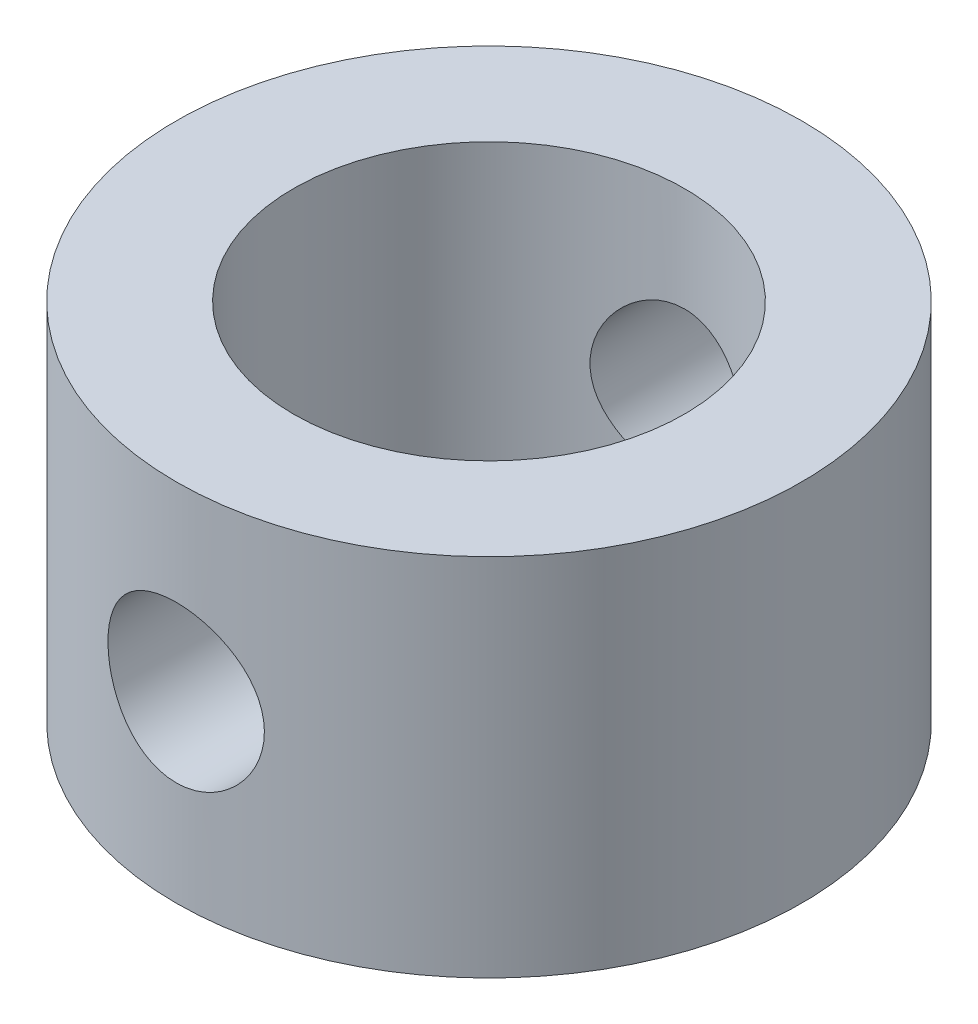
ISO-10303-21;
HEADER;
FILE_DESCRIPTION(('STEP AP214'),'2;1');
FILE_NAME('part.step','',(''),(''),'','','');
FILE_SCHEMA(('AUTOMOTIVE_DESIGN { 1 0 10303 214 1 1 1 1 }'));
ENDSEC;
DATA;
#1=APPLICATION_CONTEXT('core data for automotive mechanical design processes');
#2=APPLICATION_PROTOCOL_DEFINITION('international standard','automotive_design',2000,#1);
#3=PRODUCT_CONTEXT('',#1,'mechanical');
#4=PRODUCT('Part','Part','',(#3));
#5=PRODUCT_RELATED_PRODUCT_CATEGORY('part','',(#4));
#6=PRODUCT_DEFINITION_FORMATION('','',#4);
#7=PRODUCT_DEFINITION_CONTEXT('part definition',#1,'design');
#8=PRODUCT_DEFINITION('design','',#6,#7);
#9=PRODUCT_DEFINITION_SHAPE('','',#8);
#10=(LENGTH_UNIT() NAMED_UNIT(*) SI_UNIT(.MILLI.,.METRE.));
#11=(NAMED_UNIT(*) PLANE_ANGLE_UNIT() SI_UNIT($,.RADIAN.));
#12=(NAMED_UNIT(*) SI_UNIT($,.STERADIAN.) SOLID_ANGLE_UNIT());
#13=UNCERTAINTY_MEASURE_WITH_UNIT(LENGTH_MEASURE(1.E-05),#10,'distance_accuracy_value','');
#14=(GEOMETRIC_REPRESENTATION_CONTEXT(3) GLOBAL_UNCERTAINTY_ASSIGNED_CONTEXT((#13)) GLOBAL_UNIT_ASSIGNED_CONTEXT((#10,
#11,#12)) REPRESENTATION_CONTEXT('',''));
#15=CARTESIAN_POINT('',(0.,0.,0.));
#16=DIRECTION('',(0.,0.,1.));
#17=DIRECTION('',(1.,0.,0.));
#18=AXIS2_PLACEMENT_3D('',#15,#16,#17);
#19=CARTESIAN_POINT('',(0.,7.,0.));
#20=DIRECTION('',(0.,1.,0.));
#21=DIRECTION('',(0.,0.,1.));
#22=AXIS2_PLACEMENT_3D('',#19,#20,#21);
#23=PLANE('',#22);
#24=CARTESIAN_POINT('',(0.,7.,0.));
#25=DIRECTION('',(0.,1.,0.));
#26=DIRECTION('',(0.,0.,1.));
#27=AXIS2_PLACEMENT_3D('',#24,#25,#26);
#28=CIRCLE('',#27,12.);
#29=CARTESIAN_POINT('',(0.,7.,12.));
#30=VERTEX_POINT('',#29);
#31=EDGE_CURVE('E10',#30,#30,#28,.T.);
#32=ORIENTED_EDGE('',*,*,#31,.T.);
#33=EDGE_LOOP('',(#32));
#34=FACE_BOUND('',#33,.T.);
#35=CARTESIAN_POINT('',(0.,7.,0.));
#36=DIRECTION('',(0.,1.,0.));
#37=DIRECTION('',(0.,0.,1.));
#38=AXIS2_PLACEMENT_3D('',#35,#36,#37);
#39=CIRCLE('',#38,7.5);
#40=CARTESIAN_POINT('',(0.,7.,7.5));
#41=VERTEX_POINT('',#40);
#42=EDGE_CURVE('E62',#41,#41,#39,.T.);
#43=ORIENTED_EDGE('',*,*,#42,.F.);
#44=EDGE_LOOP('',(#43));
#45=FACE_BOUND('',#44,.T.);
#46=ADVANCED_FACE('F41',(#34,#45),#23,.T.);
#47=CARTESIAN_POINT('',(0.,-7.,0.));
#48=DIRECTION('',(0.,1.,0.));
#49=DIRECTION('',(0.,0.,1.));
#50=AXIS2_PLACEMENT_3D('',#47,#48,#49);
#51=PLANE('',#50);
#52=CARTESIAN_POINT('',(0.,-7.,0.));
#53=DIRECTION('',(0.,1.,0.));
#54=DIRECTION('',(0.,0.,1.));
#55=AXIS2_PLACEMENT_3D('',#52,#53,#54);
#56=CIRCLE('',#55,12.);
#57=CARTESIAN_POINT('',(0.,-7.,12.));
#58=VERTEX_POINT('',#57);
#59=EDGE_CURVE('E56',#58,#58,#56,.T.);
#60=ORIENTED_EDGE('',*,*,#59,.F.);
#61=EDGE_LOOP('',(#60));
#62=FACE_BOUND('',#61,.T.);
#63=CARTESIAN_POINT('',(0.,-7.,0.));
#64=DIRECTION('',(0.,1.,0.));
#65=DIRECTION('',(0.,0.,1.));
#66=AXIS2_PLACEMENT_3D('',#63,#64,#65);
#67=CIRCLE('',#66,7.5);
#68=CARTESIAN_POINT('',(0.,-7.,7.5));
#69=VERTEX_POINT('',#68);
#70=EDGE_CURVE('E65',#69,#69,#67,.T.);
#71=ORIENTED_EDGE('',*,*,#70,.T.);
#72=EDGE_LOOP('',(#71));
#73=FACE_BOUND('',#72,.T.);
#74=ADVANCED_FACE('F106',(#62,#73),#51,.F.);
#75=CARTESIAN_POINT('',(0.,7.,0.));
#76=DIRECTION('',(0.,-1.,0.));
#77=DIRECTION('',(0.,0.,-1.));
#78=AXIS2_PLACEMENT_3D('',#75,#76,#77);
#79=CYLINDRICAL_SURFACE('',#78,12.);
#80=CARTESIAN_POINT('',(0.,3.,-12.));
#81=CARTESIAN_POINT('',(-0.165752177339462,2.99999534852368,-11.9999971973602));
#82=CARTESIAN_POINT('',(-0.331556315661527,2.98621689845242,-11.9965315626365));
#83=CARTESIAN_POINT('',(-0.658412647541066,2.93154969738599,-11.9830422765979));
#84=CARTESIAN_POINT('',(-0.819462093741479,2.8906455809243,-11.9730149083995));
#85=CARTESIAN_POINT('',(-1.13204174436515,2.78312149307583,-11.9475125266406));
#86=CARTESIAN_POINT('',(-1.28358312686,2.71653240256946,-11.9320440568412));
#87=CARTESIAN_POINT('',(-1.57334426380886,2.55963721991032,-11.8973068761524));
#88=CARTESIAN_POINT('',(-1.71156356869753,2.46933032776207,-11.8780380370831));
#89=CARTESIAN_POINT('',(-1.97360385460183,2.26559842069164,-11.8373482718339));
#90=CARTESIAN_POINT('',(-2.09711138012211,2.15177685008188,-11.8158941429625));
#91=CARTESIAN_POINT('',(-2.32349785440664,1.90509559018193,-11.7734724023587));
#92=CARTESIAN_POINT('',(-2.42637447389838,1.77223375410613,-11.7525048457974));
#93=CARTESIAN_POINT('',(-2.61005308559795,1.48880954652602,-11.7130955139634));
#94=CARTESIAN_POINT('',(-2.69050443185028,1.33801353838254,-11.6946958892962));
#95=CARTESIAN_POINT('',(-2.82479381710149,1.02450317667993,-11.6629898963603));
#96=CARTESIAN_POINT('',(-2.87863611088028,0.861790733335969,-11.6496827138884));
#97=CARTESIAN_POINT('',(-2.95710967360953,0.53251300359668,-11.6300095339265));
#98=CARTESIAN_POINT('',(-2.98230453666411,0.366090207924015,-11.6235098199402));
#99=CARTESIAN_POINT('',(-3.00452355013282,0.0312628620013088,-11.6177872491918));
#100=CARTESIAN_POINT('',(-3.00155228363622,-0.137141361384274,-11.6185632085586));
#101=CARTESIAN_POINT('',(-2.96797304927941,-0.466831615490707,-11.6271841103363));
#102=CARTESIAN_POINT('',(-2.93803668038127,-0.628191242930661,-11.6348572601459));
#103=CARTESIAN_POINT('',(-2.85244837380599,-0.943522101822118,-11.6561341934214));
#104=CARTESIAN_POINT('',(-2.79679460413879,-1.09749280605784,-11.6697383993848));
#105=CARTESIAN_POINT('',(-2.66077895587437,-1.39547603250426,-11.7015022781132));
#106=CARTESIAN_POINT('',(-2.58017333446584,-1.53937234357914,-11.7197065493963));
#107=CARTESIAN_POINT('',(-2.39671255202989,-1.81183741951364,-11.7585942169198));
#108=CARTESIAN_POINT('',(-2.29385349761767,-1.9404034961345,-11.7792780466926));
#109=CARTESIAN_POINT('',(-2.06532684936244,-2.18240723138881,-11.8215176107978));
#110=CARTESIAN_POINT('',(-1.93909251633172,-2.2953089801227,-11.84308138956));
#111=CARTESIAN_POINT('',(-1.6692238350074,-2.49844248492781,-11.8841193115751));
#112=CARTESIAN_POINT('',(-1.52558895541589,-2.58867354852713,-11.9035933909882));
#113=CARTESIAN_POINT('',(-1.22423177736278,-2.74410117244877,-11.9383546418838));
#114=CARTESIAN_POINT('',(-1.06646278641725,-2.80921068050886,-11.9536272025545));
#115=CARTESIAN_POINT('',(-0.741752016285765,-2.91183461141915,-11.9781583398283));
#116=CARTESIAN_POINT('',(-0.574811998300969,-2.94935431283628,-11.9874180667856));
#117=CARTESIAN_POINT('',(-0.241079940780053,-2.99491513111768,-11.9987099854275));
#118=CARTESIAN_POINT('',(-0.074393439976419,-3.00368605215061,-12.0009210701655));
#119=CARTESIAN_POINT('',(0.258065749603018,-2.99350199588902,-11.998376096289));
#120=CARTESIAN_POINT('',(0.423838519289193,-2.97454951440173,-11.9936206648371));
#121=CARTESIAN_POINT('',(0.747228537552982,-2.91005818321725,-11.977791622547));
#122=CARTESIAN_POINT('',(0.904930237937501,-2.86491747304605,-11.9668126837158));
#123=CARTESIAN_POINT('',(1.21051458490503,-2.74978583194308,-11.9397741326831));
#124=CARTESIAN_POINT('',(1.3583962380653,-2.67979239137356,-11.9237140073996));
#125=CARTESIAN_POINT('',(1.64304626885966,-2.51552774225065,-11.8878661585244));
#126=CARTESIAN_POINT('',(1.77957088367153,-2.42084777520687,-11.868017347332));
#127=CARTESIAN_POINT('',(2.03505322728662,-2.21042018240566,-11.826890183755));
#128=CARTESIAN_POINT('',(2.1540079179465,-2.0946689207647,-11.8056115850589));
#129=CARTESIAN_POINT('',(2.37398113614497,-1.84199607831259,-11.76337913919));
#130=CARTESIAN_POINT('',(2.47448773524221,-1.70462459400088,-11.7424460836496));
#131=CARTESIAN_POINT('',(2.65102151802725,-1.41453473106284,-11.7038575676408));
#132=CARTESIAN_POINT('',(2.72704978832281,-1.26181703405911,-11.6862019616993));
#133=CARTESIAN_POINT('',(2.85190284121468,-0.946188555187524,-11.656361894336));
#134=CARTESIAN_POINT('',(2.90088879328717,-0.783344743375404,-11.6441451045097));
#135=CARTESIAN_POINT('',(2.97069131988587,-0.451380724289409,-11.626534880479));
#136=CARTESIAN_POINT('',(2.99151405495183,-0.2822618979571,-11.6211399540485));
#137=CARTESIAN_POINT('',(3.004077180673,0.0522420477232175,-11.6178980244194));
#138=CARTESIAN_POINT('',(2.99663579556158,0.217594870252894,-11.6198386546564));
#139=CARTESIAN_POINT('',(2.95475455662439,0.544607777332531,-11.6305581800657));
#140=CARTESIAN_POINT('',(2.92031524537318,0.706267936026385,-11.6393369378128));
#141=CARTESIAN_POINT('',(2.82586263888594,1.02041691813173,-11.6626252136787));
#142=CARTESIAN_POINT('',(2.76600280936085,1.17295461048066,-11.6771003047327));
#143=CARTESIAN_POINT('',(2.62252982721005,1.46593076542713,-11.7101551144901));
#144=CARTESIAN_POINT('',(2.53891338006835,1.60636754637377,-11.7287354024137));
#145=CARTESIAN_POINT('',(2.3477354972743,1.87510925800411,-11.7685126852721));
#146=CARTESIAN_POINT('',(2.23960632582452,2.00300214684794,-11.7897652966356));
#147=CARTESIAN_POINT('',(2.00357874237946,2.2390940895908,-11.8321605449252));
#148=CARTESIAN_POINT('',(1.87567564252229,2.34728846022593,-11.8533031545411));
#149=CARTESIAN_POINT('',(1.60093517340518,2.54282261712922,-11.8935531129534));
#150=CARTESIAN_POINT('',(1.45379684463277,2.62974922734316,-11.9126166673174));
#151=CARTESIAN_POINT('',(1.14653211902095,2.77749492588106,-11.9460984995023));
#152=CARTESIAN_POINT('',(0.986415126873477,2.83833272129707,-11.9605201039956));
#153=CARTESIAN_POINT('',(0.688820506486943,2.92314366065931,-11.9809611913108));
#154=CARTESIAN_POINT('',(0.552760341816137,2.95190248610687,-11.9880517010538));
#155=CARTESIAN_POINT('',(0.277812143072566,2.99033188724388,-11.997572104639));
#156=CARTESIAN_POINT('',(0.138924322485232,3.0000038986106,-12.0000023490179));
#157=CARTESIAN_POINT('',(0.,3.,-12.));
#158=B_SPLINE_CURVE_WITH_KNOTS('',3,(#80,#81,#82,#83,#84,#85,#86,#87,#88,#89,#90,#91,#92,#93,
#94,#95,#96,#97,#98,#99,#100,#101,#102,#103,#104,#105,#106,#107,#108,#109,#110,#111,#112,#113,
#114,#115,#116,#117,#118,#119,#120,#121,#122,#123,#124,#125,#126,#127,#128,#129,#130,#131,#132,
#133,#134,#135,#136,#137,#138,#139,#140,#141,#142,#143,#144,#145,#146,#147,#148,#149,#150,#151,
#152,#153,#154,#155,#156,#157),.UNSPECIFIED.,.T.,.F.,(4,2,2,2,2,2,2,2,2,2,2,2,2,2,2,2,2,2,2,2,2,
2,2,2,2,2,2,2,2,2,2,2,2,2,2,2,2,2,4),(0.,0.49674742494378,0.993776475527799,1.49020980457221,
1.98665988033866,2.49228870874278,2.99797459160124,3.51117295091614,4.02428922338737,
4.5271259020214,5.02988076232035,5.52044994020678,6.01105406938718,6.506610557544,
7.00225381678967,7.5120300194468,8.02182179123136,8.5333645802487,9.04480947383927,
9.54316617905194,10.0414780223213,10.5324054903472,11.0233825465122,11.5230717513735,
12.0228472602268,12.5348901841559,13.0469103750566,13.5558450923716,14.0646684651657,
14.5588756080898,15.0530728192383,15.5443280113065,16.0356513628556,16.5397915283158,
17.0440513955259,17.5574437101093,18.0704672765446,18.4868448589605,18.9031911209784),.UNSPECIFIED.);
#159=CARTESIAN_POINT('',(0.,3.,-12.));
#160=VERTEX_POINT('',#159);
#161=EDGE_CURVE('E92',#160,#160,#158,.T.);
#162=ORIENTED_EDGE('',*,*,#161,.T.);
#163=EDGE_LOOP('',(#162));
#164=FACE_BOUND('',#163,.T.);
#165=CARTESIAN_POINT('',(3.,0.,11.6189500386223));
#166=CARTESIAN_POINT('',(2.99999529431169,-0.165660901111892,11.6189532010543));
#167=CARTESIAN_POINT('',(2.98623149459718,-0.331373878414226,11.6225316721752));
#168=CARTESIAN_POINT('',(2.93162775055655,-0.658041093808211,11.6364223439108));
#169=CARTESIAN_POINT('',(2.89077204809053,-0.818992505361822,11.6467384634596));
#170=CARTESIAN_POINT('',(2.78338943955845,-1.13136424582462,11.6728646951538));
#171=CARTESIAN_POINT('',(2.71689567342539,-1.28279658646285,11.6886677122855));
#172=CARTESIAN_POINT('',(2.56022536951366,-1.57237302304786,11.7239783043451));
#173=CARTESIAN_POINT('',(2.47004782627282,-1.71051655449626,11.7434860365419));
#174=CARTESIAN_POINT('',(2.26645011277426,-1.97263397431466,11.7844885962675));
#175=CARTESIAN_POINT('',(2.15260426524486,-2.09627232042006,11.8060151714764));
#176=CARTESIAN_POINT('',(1.9058184769208,-2.32291367323241,11.8483545061835));
#177=CARTESIAN_POINT('',(1.77287675301637,-2.4259147507461,11.8691671987967));
#178=CARTESIAN_POINT('',(1.48937424129475,-2.60973056115753,11.908084986247));
#179=CARTESIAN_POINT('',(1.33859349143414,-2.69021566579376,11.9261482488071));
#180=CARTESIAN_POINT('',(1.02511582115131,-2.8245715729837,11.9571697431118));
#181=CARTESIAN_POINT('',(0.862420662950329,-2.87844630229862,11.9701287280121));
#182=CARTESIAN_POINT('',(0.533230510504994,-2.9569774014943,11.9892571061782));
#183=CARTESIAN_POINT('',(0.366879263458771,-2.9822035731919,11.9955587261318));
#184=CARTESIAN_POINT('',(0.0321945831153235,-3.00451005513066,12.0011231292876));
#185=CARTESIAN_POINT('',(-0.136138553445682,-3.00159452665152,12.0003869531605));
#186=CARTESIAN_POINT('',(-0.466056741517162,-2.96811017969983,11.9920571394424));
#187=CARTESIAN_POINT('',(-0.627708646803201,-2.93815640993537,11.9846160280904));
#188=CARTESIAN_POINT('',(-0.943614742241059,-2.8524344759418,11.9638900382983));
#189=CARTESIAN_POINT('',(-1.09786853811131,-2.79666493754711,11.9506048487814));
#190=CARTESIAN_POINT('',(-1.39622011050542,-2.66039691517552,11.9194501164106));
#191=CARTESIAN_POINT('',(-1.54021352929951,-2.57967954640591,11.9015402363401));
#192=CARTESIAN_POINT('',(-1.81282686702147,-2.39597318506049,11.8630788457163));
#193=CARTESIAN_POINT('',(-1.94144410525652,-2.29298031772725,11.8425268758318));
#194=CARTESIAN_POINT('',(-2.18332210525487,-2.06434950962116,11.8003645652323));
#195=CARTESIAN_POINT('',(-2.29607303722559,-1.93817412918271,11.7787406343036));
#196=CARTESIAN_POINT('',(-2.49892912788907,-1.66848003175166,11.7373805222079));
#197=CARTESIAN_POINT('',(-2.58903322813808,-1.52496050461067,11.7176444292995));
#198=CARTESIAN_POINT('',(-2.74436438706776,-1.22365195902137,11.6822459619518));
#199=CARTESIAN_POINT('',(-2.80946870091135,-1.06579712362463,11.6666038046041));
#200=CARTESIAN_POINT('',(-2.91205686190915,-0.740897438307787,11.641423681784));
#201=CARTESIAN_POINT('',(-2.94954661965919,-0.573854563218483,11.6318844101128));
#202=CARTESIAN_POINT('',(-2.99499556639911,-0.240048598164097,11.6202642720895));
#203=CARTESIAN_POINT('',(-3.00370856870294,-0.0733946479907702,11.6179930677232));
#204=CARTESIAN_POINT('',(-2.99342038861819,0.258986323902306,11.6206481203763));
#205=CARTESIAN_POINT('',(-2.97442175741976,0.424713429539331,11.6255737148436));
#206=CARTESIAN_POINT('',(-2.9099105567259,0.747737117938289,11.6418849838198));
#207=CARTESIAN_POINT('',(-2.86483688193829,0.905127271883039,11.6531636429104));
#208=CARTESIAN_POINT('',(-2.74994169800455,1.21011774942399,11.6808086191537));
#209=CARTESIAN_POINT('',(-2.680117257255,1.35771691086694,11.6971755389569));
#210=CARTESIAN_POINT('',(-2.51612480152392,1.64212953344028,11.7335536451461));
#211=CARTESIAN_POINT('',(-2.42150610460277,1.77867460805158,11.7536300232869));
#212=CARTESIAN_POINT('',(-2.21118087880335,2.03422603536177,11.7950049968534));
#213=CARTESIAN_POINT('',(-2.09547088441632,2.15322949998013,11.8163037927397));
#214=CARTESIAN_POINT('',(-1.84278816295418,2.37337325108511,11.8583688363813));
#215=CARTESIAN_POINT('',(-1.70535585759478,2.47399207505856,11.8791084247426));
#216=CARTESIAN_POINT('',(-1.41510804808403,2.6507230403415,11.9171665993643));
#217=CARTESIAN_POINT('',(-1.26229334687277,2.72683645992985,11.9344853640474));
#218=CARTESIAN_POINT('',(-0.946674605193272,2.85173524143352,11.9636413888599));
#219=CARTESIAN_POINT('',(-0.783952143083647,2.90071714125488,11.9755179602689));
#220=CARTESIAN_POINT('',(-0.452249280956421,2.9705524015301,11.9926235207495));
#221=CARTESIAN_POINT('',(-0.283270095123721,2.99141119048685,11.9978537927211));
#222=CARTESIAN_POINT('',(0.0512505793299699,3.00410276872662,12.0010250822642));
#223=CARTESIAN_POINT('',(0.216761480898066,2.99670512728622,11.9991593663997));
#224=CARTESIAN_POINT('',(0.544102489244253,2.95485651811695,11.9887768937233));
#225=CARTESIAN_POINT('',(0.705932705342786,2.92040635496049,11.9802603347151));
#226=CARTESIAN_POINT('',(1.02051310693432,2.82584334068742,11.9575629856167));
#227=CARTESIAN_POINT('',(1.17330748374259,2.76586964005686,11.9434129350718));
#228=CARTESIAN_POINT('',(1.46675115912487,2.62208826294128,11.9109386674097));
#229=CARTESIAN_POINT('',(1.6073989237969,2.53827758198855,11.8926139241627));
#230=CARTESIAN_POINT('',(1.87620578526991,2.3468542980116,11.8532174904086));
#231=CARTESIAN_POINT('',(2.00398496489501,2.23871957128851,11.8320905082499));
#232=CARTESIAN_POINT('',(2.23984506082051,2.00273144406796,11.7897194717157));
#233=CARTESIAN_POINT('',(2.34792097522977,1.87487305166651,11.7684753890191));
#234=CARTESIAN_POINT('',(2.5432860794155,1.60019575743162,11.7278242753651));
#235=CARTESIAN_POINT('',(2.63014985824914,1.45306762990424,11.7084589101987));
#236=CARTESIAN_POINT('',(2.77778068975641,1.14583353037554,11.6743186648448));
#237=CARTESIAN_POINT('',(2.83856672925646,0.985737101718459,11.6595404469964));
#238=CARTESIAN_POINT('',(2.92326758571301,0.688268964494517,11.6385572625221));
#239=CARTESIAN_POINT('',(2.95197951179064,0.552320506841589,11.631259890105));
#240=CARTESIAN_POINT('',(2.99034687771531,0.277593393006936,11.6214551574786));
#241=CARTESIAN_POINT('',(3.00000394311525,0.138814979266793,11.6189473886732));
#242=CARTESIAN_POINT('',(3.,0.,11.6189500386223));
#243=B_SPLINE_CURVE_WITH_KNOTS('',3,(#165,#166,#167,#168,#169,#170,#171,#172,#173,#174,#175,
#176,#177,#178,#179,#180,#181,#182,#183,#184,#185,#186,#187,#188,#189,#190,#191,#192,#193,#194,
#195,#196,#197,#198,#199,#200,#201,#202,#203,#204,#205,#206,#207,#208,#209,#210,#211,#212,#213,
#214,#215,#216,#217,#218,#219,#220,#221,#222,#223,#224,#225,#226,#227,#228,#229,#230,#231,#232,
#233,#234,#235,#236,#237,#238,#239,#240,#241,#242),.UNSPECIFIED.,.T.,.F.,(4,2,2,2,2,2,2,2,2,2,2,
2,2,2,2,2,2,2,2,2,2,2,2,2,2,2,2,2,2,2,2,2,2,2,2,2,2,2,4),(0.,0.496472930083363,
0.993234889714399,1.48935687259922,1.98549992106574,2.49148745031571,2.9975222577584,
3.51061795677504,4.02363791816511,4.52626501194416,5.02881778399225,5.52021915226736,
6.01164668069743,6.50751449105334,7.00346862562696,7.51284559886294,8.02224637439763,
8.53411718410083,9.04587840155457,9.54412289717045,10.042321526265,10.5323688601698,
11.0224742571164,11.5221941503692,12.0219962266799,12.5343039716432,13.046584988694,
13.5551048737425,14.0635265869678,14.5582013535888,15.0528614085831,15.5448585187759,
16.0369176689162,16.5407651590442,17.0447403788455,17.5581177274936,18.0711206565002,
18.4871739262287,18.903191701295),.UNSPECIFIED.);
#244=CARTESIAN_POINT('',(3.,0.,11.6189500386223));
#245=VERTEX_POINT('',#244);
#246=EDGE_CURVE('E86',#245,#245,#243,.T.);
#247=ORIENTED_EDGE('',*,*,#246,.T.);
#248=EDGE_LOOP('',(#247));
#249=FACE_BOUND('',#248,.T.);
#250=ORIENTED_EDGE('',*,*,#31,.F.);
#251=EDGE_LOOP('',(#250));
#252=FACE_BOUND('',#251,.T.);
#253=ORIENTED_EDGE('',*,*,#59,.T.);
#254=EDGE_LOOP('',(#253));
#255=FACE_BOUND('',#254,.T.);
#256=ADVANCED_FACE('F43',(#164,#249,#252,#255),#79,.T.);
#257=CARTESIAN_POINT('',(0.,7.,0.));
#258=DIRECTION('',(0.,-1.,0.));
#259=DIRECTION('',(0.,0.,-1.));
#260=AXIS2_PLACEMENT_3D('',#257,#258,#259);
#261=CYLINDRICAL_SURFACE('',#260,7.5);
#262=CARTESIAN_POINT('',(0.,3.,-7.5));
#263=CARTESIAN_POINT('',(-0.0806632009395358,2.9999983890229,-7.49999888970472));
#264=CARTESIAN_POINT('',(-0.161354413498373,2.99674011548,-7.4986936895007));
#265=CARTESIAN_POINT('',(-0.322146094522253,2.9837470954671,-7.49351186176526));
#266=CARTESIAN_POINT('',(-0.402246157981983,2.97400826254011,-7.48963361174618));
#267=CARTESIAN_POINT('',(-0.641096781067452,2.9351288598822,-7.47424634808757));
#268=CARTESIAN_POINT('',(-0.79815808252172,2.89632569245522,-7.45898522266242));
#269=CARTESIAN_POINT('',(-1.10247033899881,2.79468577218911,-7.42011459126984));
#270=CARTESIAN_POINT('',(-1.24975157753076,2.73192770096983,-7.39653243529675));
#271=CARTESIAN_POINT('',(-1.53159737405797,2.58447126970495,-7.34334877224069));
#272=CARTESIAN_POINT('',(-1.66616632427491,2.49978052573424,-7.31374935540466));
#273=CARTESIAN_POINT('',(-1.92525452632722,2.30664674369764,-7.24996340359365));
#274=CARTESIAN_POINT('',(-2.04909421803168,2.19734001336868,-7.2156344837394));
#275=CARTESIAN_POINT('',(-2.27726169757605,1.95989999705686,-7.14690862377684));
#276=CARTESIAN_POINT('',(-2.38157993941976,1.8317575548035,-7.11251165865921));
#277=CARTESIAN_POINT('',(-2.5723120820679,1.55335789398784,-7.04584188546733));
#278=CARTESIAN_POINT('',(-2.65772253361338,1.40237027079118,-7.01373174174385));
#279=CARTESIAN_POINT('',(-2.80163201676496,1.08669540254387,-6.95750470553339));
#280=CARTESIAN_POINT('',(-2.86014383023324,0.922014708274903,-6.93338401809298));
#281=CARTESIAN_POINT('',(-2.94584825055478,0.591431499566553,-6.8973953654561));
#282=CARTESIAN_POINT('',(-2.974340952837,0.425923146617134,-6.88502130539265));
#283=CARTESIAN_POINT('',(-3.00325943833354,0.0920475025576348,-6.87246006067861));
#284=CARTESIAN_POINT('',(-3.00369902341366,-0.0763183419086437,-6.87226688315068));
#285=CARTESIAN_POINT('',(-2.97748405223855,-0.398635007225333,-6.88365750391268));
#286=CARTESIAN_POINT('',(-2.95271297167583,-0.552773571723856,-6.89442262441713));
#287=CARTESIAN_POINT('',(-2.87992032013237,-0.854489334113111,-6.92514281294201));
#288=CARTESIAN_POINT('',(-2.83189469212407,-1.00206538218921,-6.94509948450627));
#289=CARTESIAN_POINT('',(-2.71304209891512,-1.29002675426026,-6.99239227665171));
#290=CARTESIAN_POINT('',(-2.64176979349676,-1.43020385857296,-7.0198706892988));
#291=CARTESIAN_POINT('',(-2.47875969107453,-1.69712372455143,-7.07907174576133));
#292=CARTESIAN_POINT('',(-2.38701420764467,-1.82386141410673,-7.11079598182861));
#293=CARTESIAN_POINT('',(-2.17732589918875,-2.07061459320028,-7.17790105116005));
#294=CARTESIAN_POINT('',(-2.05790619445786,-2.1893530941683,-7.21337497464924));
#295=CARTESIAN_POINT('',(-1.80047164114338,-2.40552671700379,-7.28189737436726));
#296=CARTESIAN_POINT('',(-1.66245309800113,-2.50295759611564,-7.31494536667799));
#297=CARTESIAN_POINT('',(-1.36811647890929,-2.67542617112355,-7.37572021897015));
#298=CARTESIAN_POINT('',(-1.21149073701985,-2.74998342179553,-7.40332905143173));
#299=CARTESIAN_POINT('',(-0.886535648224183,-2.87125179161714,-7.44922242493087));
#300=CARTESIAN_POINT('',(-0.718212295274479,-2.91797705633613,-7.4675117019356));
#301=CARTESIAN_POINT('',(-0.385343831411759,-2.97967244312955,-7.49184209260378));
#302=CARTESIAN_POINT('',(-0.221164940978293,-2.99635868138034,-7.49854418750274));
#303=CARTESIAN_POINT('',(0.107767964711718,-3.00256965079292,-7.50102717765943));
#304=CARTESIAN_POINT('',(0.272521819835824,-2.99210142232124,-7.49681090373437));
#305=CARTESIAN_POINT('',(0.590149108683041,-2.94556237117203,-7.4783635059563));
#306=CARTESIAN_POINT('',(0.743223737663437,-2.91066302947361,-7.46459087018283));
#307=CARTESIAN_POINT('',(1.04120314209095,-2.81784643753521,-7.42889162108252));
#308=CARTESIAN_POINT('',(1.18610686533643,-2.7599262304967,-7.40696396034803));
#309=CARTESIAN_POINT('',(1.46861817872592,-2.62082259048036,-7.3562489215621));
#310=CARTESIAN_POINT('',(1.60586703413639,-2.53898179193636,-7.32727223969677));
#311=CARTESIAN_POINT('',(1.86516538686655,-2.35508951414045,-7.26560047118316));
#312=CARTESIAN_POINT('',(1.98720876112942,-2.25302993561202,-7.23290389665513));
#313=CARTESIAN_POINT('',(2.2210845645563,-2.02369498057988,-7.16467676457054));
#314=CARTESIAN_POINT('',(2.33171090075939,-1.89519968775731,-7.12910162137139));
#315=CARTESIAN_POINT('',(2.53012679607026,-1.62083987546932,-7.06112509376137));
#316=CARTESIAN_POINT('',(2.6179125918181,-1.47497249942789,-7.02872423291408));
#317=CARTESIAN_POINT('',(2.76871125308743,-1.16780745817163,-6.97071449859905));
#318=CARTESIAN_POINT('',(2.83147589251401,-1.00637400141696,-6.94517446320966));
#319=CARTESIAN_POINT('',(2.92844432884615,-0.673899522192015,-6.90485510223108));
#320=CARTESIAN_POINT('',(2.96266920524751,-0.502865690403396,-6.89006783567176));
#321=CARTESIAN_POINT('',(2.9995734283829,-0.169308148152971,-6.87407638928379));
#322=CARTESIAN_POINT('',(3.00434563234764,-0.00705774354923372,-6.87197131434659));
#323=CARTESIAN_POINT('',(2.98770473002408,0.315817289508826,-6.87922254127235));
#324=CARTESIAN_POINT('',(2.96629494876877,0.476442121794098,-6.88857738776018));
#325=CARTESIAN_POINT('',(2.89960708102334,0.784998274274975,-6.91689973341124));
#326=CARTESIAN_POINT('',(2.85530635681061,0.933180373161245,-6.93547246725062));
#327=CARTESIAN_POINT('',(2.7450080562502,1.22006798291911,-6.97986002865438));
#328=CARTESIAN_POINT('',(2.67900448789151,1.35877086385317,-7.00567685597585));
#329=CARTESIAN_POINT('',(2.52280960319953,1.63141427718623,-7.06347910401242));
#330=CARTESIAN_POINT('',(2.43144976133988,1.76462742397582,-7.09573308125317));
#331=CARTESIAN_POINT('',(2.2288364197758,2.01449055720097,-7.16195721907533));
#332=CARTESIAN_POINT('',(2.1175769239766,2.13113553231325,-7.1959278947067));
#333=CARTESIAN_POINT('',(1.86976526416226,2.35230196481483,-7.26440289511609));
#334=CARTESIAN_POINT('',(1.73204093441049,2.45554705905594,-7.29879901943986));
#335=CARTESIAN_POINT('',(1.43982353523661,2.63751446935513,-7.36200845178942));
#336=CARTESIAN_POINT('',(1.28532271229705,2.71622538095622,-7.39081916114845));
#337=CARTESIAN_POINT('',(1.04589046292377,2.81307350088879,-7.42714827886077));
#338=CARTESIAN_POINT('',(0.965550642326296,2.84165597012401,-7.438042523706));
#339=CARTESIAN_POINT('',(0.802472015195126,2.89193765829433,-7.45739623794253));
#340=CARTESIAN_POINT('',(0.719734347003783,2.91364008684478,-7.46585684248286));
#341=CARTESIAN_POINT('',(0.55270755587739,2.94988203096378,-7.48007543500346));
#342=CARTESIAN_POINT('',(0.46842293787299,2.9644397091379,-7.48584027408325));
#343=CARTESIAN_POINT('',(0.298814608941242,2.98630365279151,-7.49452509406316));
#344=CARTESIAN_POINT('',(0.213491680311739,2.99361507225066,-7.49744709693401));
#345=CARTESIAN_POINT('',(0.0853730051866015,2.99908952040527,-7.49963590220856));
#346=CARTESIAN_POINT('',(0.0426904255930871,3.00000085259817,-7.50000058761588));
#347=CARTESIAN_POINT('',(0.,3.,-7.5));
#348=B_SPLINE_CURVE_WITH_KNOTS('',3,(#262,#263,#264,#265,#266,#267,#268,#269,#270,#271,#272,
#273,#274,#275,#276,#277,#278,#279,#280,#281,#282,#283,#284,#285,#286,#287,#288,#289,#290,#291,
#292,#293,#294,#295,#296,#297,#298,#299,#300,#301,#302,#303,#304,#305,#306,#307,#308,#309,#310,
#311,#312,#313,#314,#315,#316,#317,#318,#319,#320,#321,#322,#323,#324,#325,#326,#327,#328,#329,
#330,#331,#332,#333,#334,#335,#336,#337,#338,#339,#340,#341,#342,#343,#344,#345,#346,#347),
.UNSPECIFIED.,.T.,.F.,(4,2,2,2,2,2,2,2,2,2,2,2,2,2,2,2,2,2,2,2,2,2,2,2,2,2,2,2,2,2,2,2,2,2,2,2,
2,2,2,2,2,2,4),(0.,0.241952995066616,0.484058703589862,0.968979675762156,1.45232140795763,
1.93549552527002,2.43941494725621,2.94358014576643,3.47018310403851,3.99653556852428,
4.49901580138268,5.00124881685758,5.46852914780512,5.93589103065598,6.4127911162975,
6.88987055088801,7.40382945961362,7.91789061441126,8.44210791925736,8.96605856352212,
9.45899198973538,9.9517976253665,10.4224610552807,10.8931849567222,11.3783069227892,
11.8636236142998,12.3809813411815,12.8984242574715,13.4208798989277,13.9429493115043,
14.4274493227065,14.9118878102609,15.3771690000468,15.8425787588927,16.3346362426656,
16.8268422420412,17.3509605748228,17.8753221764233,18.1329380344125,18.3904335342851,
18.6472710222664,18.9039257004315,19.0319776028183),.UNSPECIFIED.);
#349=CARTESIAN_POINT('',(0.,3.,-7.5));
#350=VERTEX_POINT('',#349);
#351=EDGE_CURVE('E46',#350,#350,#348,.T.);
#352=ORIENTED_EDGE('',*,*,#351,.F.);
#353=EDGE_LOOP('',(#352));
#354=FACE_BOUND('',#353,.T.);
#355=CARTESIAN_POINT('',(3.,0.,6.87386354243376));
#356=CARTESIAN_POINT('',(2.99999310102034,-0.160685534569437,6.87387034169605));
#357=CARTESIAN_POINT('',(2.9870126033011,-0.321639441497766,6.87957650695683));
#358=CARTESIAN_POINT('',(2.93560066312235,-0.63890862614936,6.901666249599));
#359=CARTESIAN_POINT('',(2.89710418548511,-0.795210981507777,6.9180771094252));
#360=CARTESIAN_POINT('',(2.79635331714323,-1.09807771345624,6.95940616078833));
#361=CARTESIAN_POINT('',(2.73418843497826,-1.24467636493683,6.98429226391323));
#362=CARTESIAN_POINT('',(2.58813019791228,-1.52532803229345,7.0397201578331));
#363=CARTESIAN_POINT('',(2.5042415873656,-1.65938377878616,7.07026071330917));
#364=CARTESIAN_POINT('',(2.31198302134881,-1.9188904718165,7.13551292343503));
#365=CARTESIAN_POINT('',(2.20256905254826,-2.04353459909587,7.17035875533909));
#366=CARTESIAN_POINT('',(1.96456364269823,-2.2732935312837,7.23918686872916));
#367=CARTESIAN_POINT('',(1.83596552816021,-2.37840151156456,7.27316884487642));
#368=CARTESIAN_POINT('',(1.55700947005955,-2.57010958546457,7.33805111462092));
#369=CARTESIAN_POINT('',(1.40599344962864,-2.6558164495289,7.36877705418855));
#370=CARTESIAN_POINT('',(1.09023798310296,-2.80026535526068,7.42205891553774));
#371=CARTESIAN_POINT('',(0.925504153615326,-2.8590183693733,7.44461816104874));
#372=CARTESIAN_POINT('',(0.595449640559631,-2.94501222898963,7.47807487485913));
#373=CARTESIAN_POINT('',(0.430543477287476,-2.97364097095533,7.48948405155942));
#374=CARTESIAN_POINT('',(0.0978994928759443,-3.00304272867217,7.50120466031146));
#375=CARTESIAN_POINT('',(-0.0698372487591157,-3.0038261339487,7.50152023155834));
#376=CARTESIAN_POINT('',(-0.393348742053132,-2.9782758452937,7.49132944230918));
#377=CARTESIAN_POINT('',(-0.549266179305685,-2.95346284086793,7.48142995157228));
#378=CARTESIAN_POINT('',(-0.85450966383287,-2.88001068554555,7.45273937203712));
#379=CARTESIAN_POINT('',(-1.00383522658686,-2.8313697864023,7.43394763082012));
#380=CARTESIAN_POINT('',(-1.29434690776584,-2.71104527568261,7.388952366862));
#381=CARTESIAN_POINT('',(-1.43537643506834,-2.63902542777692,7.36264140699335));
#382=CARTESIAN_POINT('',(-1.70371222611197,-2.47430248962126,7.30521877770412));
#383=CARTESIAN_POINT('',(-1.83101376407694,-2.38159231034975,7.27410546400724));
#384=CARTESIAN_POINT('',(-2.07715324198526,-2.17102629608418,7.20782455764184));
#385=CARTESIAN_POINT('',(-2.19488676789948,-2.0519191611408,7.17252489767638));
#386=CARTESIAN_POINT('',(-2.40916112308898,-1.795514142252,7.10342491459894));
#387=CARTESIAN_POINT('',(-2.50569501568047,-1.65821032770659,7.06962508512114));
#388=CARTESIAN_POINT('',(-2.67735628307891,-1.36437146643909,7.00645346113535));
#389=CARTESIAN_POINT('',(-2.75180197745439,-1.20740275449202,6.97723371086562));
#390=CARTESIAN_POINT('',(-2.87276438979969,-0.881676764531668,6.92831385516127));
#391=CARTESIAN_POINT('',(-2.91929924756697,-0.712927222910116,6.90860756836966));
#392=CARTESIAN_POINT('',(-2.98043242328235,-0.379446333798846,6.88244639554074));
#393=CARTESIAN_POINT('',(-2.99680814522182,-0.215099329307163,6.87525549684207));
#394=CARTESIAN_POINT('',(-3.00234198966433,0.114115811639338,6.87284246803558));
#395=CARTESIAN_POINT('',(-2.99150836588693,0.27898377491348,6.87761670840543));
#396=CARTESIAN_POINT('',(-2.94454934218505,0.594688402435415,6.8978406653867));
#397=CARTESIAN_POINT('',(-2.90989959303579,0.745789406100091,6.91266686697452));
#398=CARTESIAN_POINT('',(-2.81820628036631,1.03993260717818,6.9505507654101));
#399=CARTESIAN_POINT('',(-2.76115775145341,1.18297300966073,6.97361028732897));
#400=CARTESIAN_POINT('',(-2.62370345922236,1.46340353669348,7.02650672790152));
#401=CARTESIAN_POINT('',(-2.54244430239697,1.6003292830418,7.05658056958766));
#402=CARTESIAN_POINT('',(-2.35974783666273,1.85922448116238,7.11975577736692));
#403=CARTESIAN_POINT('',(-2.25830231022284,1.98118780919317,7.15285837344067));
#404=CARTESIAN_POINT('',(-2.02926631752087,2.21606011289906,7.22131373957124));
#405=CARTESIAN_POINT('',(-1.90029814416816,2.3276348479374,7.2566521092785));
#406=CARTESIAN_POINT('',(-1.62462545005276,2.52776561491466,7.32329691851298));
#407=CARTESIAN_POINT('',(-1.47792020769991,2.61632070989268,7.35460319389703));
#408=CARTESIAN_POINT('',(-1.17041990100452,2.76757143969501,7.40975573850584));
#409=CARTESIAN_POINT('',(-1.00962822149812,2.8302732662605,7.4336037936099));
#410=CARTESIAN_POINT('',(-0.678590386371823,2.92732327859963,7.47109070203356));
#411=CARTESIAN_POINT('',(-0.50834941541523,2.96168685211604,7.48473509559155));
#412=CARTESIAN_POINT('',(-0.175224765543923,2.99925705247927,7.49968512317788));
#413=CARTESIAN_POINT('',(-0.0125857389781312,3.00435019284304,7.50173770124618));
#414=CARTESIAN_POINT('',(0.311150753688398,2.9882167809248,7.49529063560582));
#415=CARTESIAN_POINT('',(0.472248449421579,2.96699421276663,7.48679258923161));
#416=CARTESIAN_POINT('',(0.783256352600095,2.90017981800017,7.46057270072754));
#417=CARTESIAN_POINT('',(0.933358205797302,2.85535658286517,7.44314221048496));
#418=CARTESIAN_POINT('',(1.2238835333139,2.74342079117839,7.40092421651037));
#419=CARTESIAN_POINT('',(1.36430521678368,2.67630412359136,7.37613535594289));
#420=CARTESIAN_POINT('',(1.63830455820773,2.51834520997015,7.320271419178));
#421=CARTESIAN_POINT('',(1.77130556278108,2.4265855870123,7.288966960308));
#422=CARTESIAN_POINT('',(2.0205810602219,2.22331719187951,7.2238410334062));
#423=CARTESIAN_POINT('',(2.13684859379602,2.11180024558768,7.19001852696379));
#424=CARTESIAN_POINT('',(2.35680182841674,1.86402727972701,7.1210665105152));
#425=CARTESIAN_POINT('',(2.45926306504163,1.72666713728385,7.08598570842144));
#426=CARTESIAN_POINT('',(2.63977144144724,1.43558634641876,7.02074485276124));
#427=CARTESIAN_POINT('',(2.71781571083651,1.28186377731968,6.99058537793172));
#428=CARTESIAN_POINT('',(2.84098572677451,0.976445720294704,6.94138371358595));
#429=CARTESIAN_POINT('',(2.88843803497901,0.825807595931337,6.92158645020622));
#430=CARTESIAN_POINT('',(2.95907986392734,0.518266437761038,6.89168739051179));
#431=CARTESIAN_POINT('',(2.98233699287412,0.361382139863468,6.88155858435653));
#432=CARTESIAN_POINT('',(2.99538303278269,0.16983264133272,6.87587645913135));
#433=CARTESIAN_POINT('',(2.99711296127843,0.135897779465353,6.87512296675926));
#434=CARTESIAN_POINT('',(2.99942221686375,0.0679792848041659,6.87411577084084));
#435=CARTESIAN_POINT('',(3.0000014595918,0.0339956486172635,6.8738621039388));
#436=CARTESIAN_POINT('',(3.,0.,6.87386354243376));
#437=B_SPLINE_CURVE_WITH_KNOTS('',3,(#355,#356,#357,#358,#359,#360,#361,#362,#363,#364,#365,
#366,#367,#368,#369,#370,#371,#372,#373,#374,#375,#376,#377,#378,#379,#380,#381,#382,#383,#384,
#385,#386,#387,#388,#389,#390,#391,#392,#393,#394,#395,#396,#397,#398,#399,#400,#401,#402,#403,
#404,#405,#406,#407,#408,#409,#410,#411,#412,#413,#414,#415,#416,#417,#418,#419,#420,#421,#422,
#423,#424,#425,#426,#427,#428,#429,#430,#431,#432,#433,#434,#435,#436),.UNSPECIFIED.,.T.,.F.,(4,
2,2,2,2,2,2,2,2,2,2,2,2,2,2,2,2,2,2,2,2,2,2,2,2,2,2,2,2,2,2,2,2,2,2,2,2,2,2,2,4),(0.,
0.481916473151481,0.965066003733368,1.44640623494008,1.92764143235792,2.43383427426637,
2.94020361522513,3.46654003637142,3.9926620045422,4.49331274330775,4.99377667958508,
5.46612967245454,5.93851732693589,6.41802450352347,6.89769622410047,7.40886066122034,
7.92019210690691,8.44596688075886,8.97139957200152,9.46473221286631,9.95791522361909,
10.4230087212772,10.8882053797746,11.3722673197905,11.8565267178877,12.3765560137047,
12.8966064727912,13.4165323096922,13.936175639312,14.4219155963393,14.907582022689,
15.3783299166503,15.8491646674288,16.3408057670989,16.8326507484631,17.3549437992842,
17.8772982263878,18.3527499122861,18.8268694532887,18.928819278144,19.0307765770883),.UNSPECIFIED.);
#438=CARTESIAN_POINT('',(3.,0.,6.87386354243376));
#439=VERTEX_POINT('',#438);
#440=EDGE_CURVE('E67',#439,#439,#437,.T.);
#441=ORIENTED_EDGE('',*,*,#440,.F.);
#442=EDGE_LOOP('',(#441));
#443=FACE_BOUND('',#442,.T.);
#444=ORIENTED_EDGE('',*,*,#42,.T.);
#445=EDGE_LOOP('',(#444));
#446=FACE_BOUND('',#445,.T.);
#447=ORIENTED_EDGE('',*,*,#70,.F.);
#448=EDGE_LOOP('',(#447));
#449=FACE_BOUND('',#448,.T.);
#450=ADVANCED_FACE('F73',(#354,#443,#446,#449),#261,.F.);
#451=CARTESIAN_POINT('',(0.,0.,-12.));
#452=DIRECTION('',(0.,0.,1.));
#453=DIRECTION('',(1.,0.,0.));
#454=AXIS2_PLACEMENT_3D('',#451,#452,#453);
#455=CYLINDRICAL_SURFACE('',#454,3.);
#456=ORIENTED_EDGE('',*,*,#440,.T.);
#457=EDGE_LOOP('',(#456));
#458=FACE_BOUND('',#457,.T.);
#459=ORIENTED_EDGE('',*,*,#246,.F.);
#460=EDGE_LOOP('',(#459));
#461=FACE_BOUND('',#460,.T.);
#462=ADVANCED_FACE('F79',(#458,#461),#455,.F.);
#463=ORIENTED_EDGE('',*,*,#351,.T.);
#464=EDGE_LOOP('',(#463));
#465=FACE_BOUND('',#464,.T.);
#466=ORIENTED_EDGE('',*,*,#161,.F.);
#467=EDGE_LOOP('',(#466));
#468=FACE_BOUND('',#467,.T.);
#469=ADVANCED_FACE('F76',(#465,#468),#455,.F.);
#470=CLOSED_SHELL('',(#46,#74,#256,#450,#462,#469));
#471=MANIFOLD_SOLID_BREP('B2',#470);
#472=ADVANCED_BREP_SHAPE_REPRESENTATION('',(#18,#471),#14);
#473=SHAPE_DEFINITION_REPRESENTATION(#9,#472);
ENDSEC;
END-ISO-10303-21;
